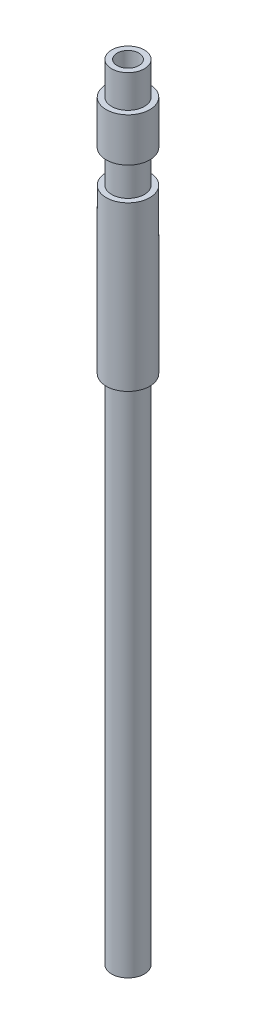
ISO-10303-21;
HEADER;
FILE_DESCRIPTION(('STEP AP214'),'2;1');
FILE_NAME('part.step','',(''),(''),'','','');
FILE_SCHEMA(('AUTOMOTIVE_DESIGN { 1 0 10303 214 1 1 1 1 }'));
ENDSEC;
DATA;
#1=APPLICATION_CONTEXT('core data for automotive mechanical design processes');
#2=APPLICATION_PROTOCOL_DEFINITION('international standard','automotive_design',2000,#1);
#3=PRODUCT_CONTEXT('',#1,'mechanical');
#4=PRODUCT('Part','Part','',(#3));
#5=PRODUCT_RELATED_PRODUCT_CATEGORY('part','',(#4));
#6=PRODUCT_DEFINITION_FORMATION('','',#4);
#7=PRODUCT_DEFINITION_CONTEXT('part definition',#1,'design');
#8=PRODUCT_DEFINITION('design','',#6,#7);
#9=PRODUCT_DEFINITION_SHAPE('','',#8);
#10=(LENGTH_UNIT() NAMED_UNIT(*) SI_UNIT(.MILLI.,.METRE.));
#11=(NAMED_UNIT(*) PLANE_ANGLE_UNIT() SI_UNIT($,.RADIAN.));
#12=(NAMED_UNIT(*) SI_UNIT($,.STERADIAN.) SOLID_ANGLE_UNIT());
#13=UNCERTAINTY_MEASURE_WITH_UNIT(LENGTH_MEASURE(1.E-05),#10,'distance_accuracy_value','');
#14=(GEOMETRIC_REPRESENTATION_CONTEXT(3) GLOBAL_UNCERTAINTY_ASSIGNED_CONTEXT((#13)) GLOBAL_UNIT_ASSIGNED_CONTEXT((#10,
#11,#12)) REPRESENTATION_CONTEXT('',''));
#15=CARTESIAN_POINT('',(0.,0.,0.));
#16=DIRECTION('',(0.,0.,1.));
#17=DIRECTION('',(1.,0.,0.));
#18=AXIS2_PLACEMENT_3D('',#15,#16,#17);
#19=CARTESIAN_POINT('',(0.,0.,0.));
#20=DIRECTION('',(0.,1.,0.));
#21=DIRECTION('',(0.,0.,1.));
#22=AXIS2_PLACEMENT_3D('',#19,#20,#21);
#23=PLANE('',#22);
#24=CARTESIAN_POINT('',(0.,0.,0.));
#25=DIRECTION('',(0.,1.,0.));
#26=DIRECTION('',(0.,0.,1.));
#27=AXIS2_PLACEMENT_3D('',#24,#25,#26);
#28=CIRCLE('',#27,1.);
#29=CARTESIAN_POINT('',(0.,0.,1.));
#30=VERTEX_POINT('',#29);
#31=EDGE_CURVE('E36',#30,#30,#28,.T.);
#32=ORIENTED_EDGE('',*,*,#31,.T.);
#33=EDGE_LOOP('',(#32));
#34=FACE_BOUND('',#33,.T.);
#35=CARTESIAN_POINT('',(0.,0.,0.));
#36=DIRECTION('',(0.,-1.,0.));
#37=DIRECTION('',(0.,0.,-1.));
#38=AXIS2_PLACEMENT_3D('',#35,#36,#37);
#39=CIRCLE('',#38,1.5);
#40=CARTESIAN_POINT('',(0.,0.,-1.5));
#41=VERTEX_POINT('',#40);
#42=EDGE_CURVE('E71',#41,#41,#39,.T.);
#43=ORIENTED_EDGE('',*,*,#42,.T.);
#44=EDGE_LOOP('',(#43));
#45=FACE_BOUND('',#44,.T.);
#46=ADVANCED_FACE('F32',(#34,#45),#23,.F.);
#47=CARTESIAN_POINT('',(0.,72.,0.));
#48=DIRECTION('',(0.,-1.,0.));
#49=DIRECTION('',(0.,0.,-1.));
#50=AXIS2_PLACEMENT_3D('',#47,#48,#49);
#51=CYLINDRICAL_SURFACE('',#50,2.);
#52=CARTESIAN_POINT('',(0.,47.,0.));
#53=DIRECTION('',(0.,-1.,0.));
#54=DIRECTION('',(0.,0.,-1.));
#55=AXIS2_PLACEMENT_3D('',#52,#53,#54);
#56=CIRCLE('',#55,1.99999999999999);
#57=CARTESIAN_POINT('',(0.,47.,-1.99999999999999));
#58=VERTEX_POINT('',#57);
#59=EDGE_CURVE('E65',#58,#58,#56,.T.);
#60=ORIENTED_EDGE('',*,*,#59,.F.);
#61=EDGE_LOOP('',(#60));
#62=FACE_BOUND('',#61,.T.);
#63=CARTESIAN_POINT('',(0.,62.,0.));
#64=DIRECTION('',(0.,1.,0.));
#65=DIRECTION('',(0.,0.,1.));
#66=AXIS2_PLACEMENT_3D('',#63,#64,#65);
#67=CIRCLE('',#66,2.);
#68=CARTESIAN_POINT('',(0.,62.,2.));
#69=VERTEX_POINT('',#68);
#70=EDGE_CURVE('E53',#69,#69,#67,.T.);
#71=ORIENTED_EDGE('',*,*,#70,.F.);
#72=EDGE_LOOP('',(#71));
#73=FACE_BOUND('',#72,.T.);
#74=ADVANCED_FACE('F34',(#62,#73),#51,.T.);
#75=CARTESIAN_POINT('',(0.,69.,0.));
#76=DIRECTION('',(0.,1.,0.));
#77=DIRECTION('',(0.,0.,1.));
#78=AXIS2_PLACEMENT_3D('',#75,#76,#77);
#79=CIRCLE('',#78,2.);
#80=CARTESIAN_POINT('',(0.,69.,2.));
#81=VERTEX_POINT('',#80);
#82=EDGE_CURVE('E43',#81,#81,#79,.T.);
#83=ORIENTED_EDGE('',*,*,#82,.F.);
#84=EDGE_LOOP('',(#83));
#85=FACE_BOUND('',#84,.T.);
#86=CARTESIAN_POINT('',(0.,65.,0.));
#87=DIRECTION('',(0.,1.,0.));
#88=DIRECTION('',(0.,0.,1.));
#89=AXIS2_PLACEMENT_3D('',#86,#87,#88);
#90=CIRCLE('',#89,2.);
#91=CARTESIAN_POINT('',(0.,65.,2.));
#92=VERTEX_POINT('',#91);
#93=EDGE_CURVE('E62',#92,#92,#90,.T.);
#94=ORIENTED_EDGE('',*,*,#93,.T.);
#95=EDGE_LOOP('',(#94));
#96=FACE_BOUND('',#95,.T.);
#97=ADVANCED_FACE('F91',(#85,#96),#51,.T.);
#98=CARTESIAN_POINT('',(0.,72.,0.));
#99=DIRECTION('',(0.,1.,0.));
#100=DIRECTION('',(0.,0.,1.));
#101=AXIS2_PLACEMENT_3D('',#98,#99,#100);
#102=PLANE('',#101);
#103=CARTESIAN_POINT('',(0.,72.,0.));
#104=DIRECTION('',(0.,1.,0.));
#105=DIRECTION('',(0.,0.,1.));
#106=AXIS2_PLACEMENT_3D('',#103,#104,#105);
#107=CIRCLE('',#106,1.);
#108=CARTESIAN_POINT('',(0.,72.,1.));
#109=VERTEX_POINT('',#108);
#110=EDGE_CURVE('E10',#109,#109,#107,.T.);
#111=ORIENTED_EDGE('',*,*,#110,.F.);
#112=EDGE_LOOP('',(#111));
#113=FACE_BOUND('',#112,.T.);
#114=CARTESIAN_POINT('',(0.,72.,0.));
#115=DIRECTION('',(0.,1.,0.));
#116=DIRECTION('',(0.,0.,1.));
#117=AXIS2_PLACEMENT_3D('',#114,#115,#116);
#118=CIRCLE('',#117,1.5);
#119=CARTESIAN_POINT('',(0.,72.,1.5));
#120=VERTEX_POINT('',#119);
#121=EDGE_CURVE('E50',#120,#120,#118,.T.);
#122=ORIENTED_EDGE('',*,*,#121,.T.);
#123=EDGE_LOOP('',(#122));
#124=FACE_BOUND('',#123,.T.);
#125=ADVANCED_FACE('F113',(#113,#124),#102,.T.);
#126=CARTESIAN_POINT('',(0.,72.,0.));
#127=DIRECTION('',(0.,-1.,0.));
#128=DIRECTION('',(0.,0.,-1.));
#129=AXIS2_PLACEMENT_3D('',#126,#127,#128);
#130=CYLINDRICAL_SURFACE('',#129,1.);
#131=ORIENTED_EDGE('',*,*,#110,.T.);
#132=EDGE_LOOP('',(#131));
#133=FACE_BOUND('',#132,.T.);
#134=ORIENTED_EDGE('',*,*,#31,.F.);
#135=EDGE_LOOP('',(#134));
#136=FACE_BOUND('',#135,.T.);
#137=ADVANCED_FACE('F118',(#133,#136),#130,.F.);
#138=CARTESIAN_POINT('',(2.,69.,0.));
#139=DIRECTION('',(0.,1.,0.));
#140=DIRECTION('',(0.,0.,1.));
#141=AXIS2_PLACEMENT_3D('',#138,#139,#140);
#142=PLANE('',#141);
#143=ORIENTED_EDGE('',*,*,#82,.T.);
#144=EDGE_LOOP('',(#143));
#145=FACE_BOUND('',#144,.T.);
#146=CARTESIAN_POINT('',(0.,69.,0.));
#147=DIRECTION('',(0.,1.,0.));
#148=DIRECTION('',(0.,0.,1.));
#149=AXIS2_PLACEMENT_3D('',#146,#147,#148);
#150=CIRCLE('',#149,1.5);
#151=CARTESIAN_POINT('',(0.,69.,1.5));
#152=VERTEX_POINT('',#151);
#153=EDGE_CURVE('E47',#152,#152,#150,.T.);
#154=ORIENTED_EDGE('',*,*,#153,.F.);
#155=EDGE_LOOP('',(#154));
#156=FACE_BOUND('',#155,.T.);
#157=ADVANCED_FACE('F129',(#145,#156),#142,.T.);
#158=CARTESIAN_POINT('',(0.,72.,0.));
#159=DIRECTION('',(0.,1.,0.));
#160=DIRECTION('',(0.,0.,1.));
#161=AXIS2_PLACEMENT_3D('',#158,#159,#160);
#162=CYLINDRICAL_SURFACE('',#161,1.5);
#163=ORIENTED_EDGE('',*,*,#153,.T.);
#164=EDGE_LOOP('',(#163));
#165=FACE_BOUND('',#164,.T.);
#166=ORIENTED_EDGE('',*,*,#121,.F.);
#167=EDGE_LOOP('',(#166));
#168=FACE_BOUND('',#167,.T.);
#169=ADVANCED_FACE('F98',(#165,#168),#162,.T.);
#170=CARTESIAN_POINT('',(2.,62.,0.));
#171=DIRECTION('',(0.,1.,0.));
#172=DIRECTION('',(0.,0.,1.));
#173=AXIS2_PLACEMENT_3D('',#170,#171,#172);
#174=PLANE('',#173);
#175=ORIENTED_EDGE('',*,*,#70,.T.);
#176=EDGE_LOOP('',(#175));
#177=FACE_BOUND('',#176,.T.);
#178=CARTESIAN_POINT('',(0.,62.,0.));
#179=DIRECTION('',(0.,1.,0.));
#180=DIRECTION('',(0.,0.,1.));
#181=AXIS2_PLACEMENT_3D('',#178,#179,#180);
#182=CIRCLE('',#181,1.5);
#183=CARTESIAN_POINT('',(0.,62.,1.5));
#184=VERTEX_POINT('',#183);
#185=EDGE_CURVE('E56',#184,#184,#182,.T.);
#186=ORIENTED_EDGE('',*,*,#185,.F.);
#187=EDGE_LOOP('',(#186));
#188=FACE_BOUND('',#187,.T.);
#189=ADVANCED_FACE('F94',(#177,#188),#174,.T.);
#190=CARTESIAN_POINT('',(0.,72.,0.));
#191=DIRECTION('',(0.,1.,0.));
#192=DIRECTION('',(0.,0.,1.));
#193=AXIS2_PLACEMENT_3D('',#190,#191,#192);
#194=CYLINDRICAL_SURFACE('',#193,1.5);
#195=ORIENTED_EDGE('',*,*,#185,.T.);
#196=EDGE_LOOP('',(#195));
#197=FACE_BOUND('',#196,.T.);
#198=CARTESIAN_POINT('',(0.,65.,0.));
#199=DIRECTION('',(0.,1.,0.));
#200=DIRECTION('',(0.,0.,1.));
#201=AXIS2_PLACEMENT_3D('',#198,#199,#200);
#202=CIRCLE('',#201,1.5);
#203=CARTESIAN_POINT('',(0.,65.,1.5));
#204=VERTEX_POINT('',#203);
#205=EDGE_CURVE('E59',#204,#204,#202,.T.);
#206=ORIENTED_EDGE('',*,*,#205,.F.);
#207=EDGE_LOOP('',(#206));
#208=FACE_BOUND('',#207,.T.);
#209=ADVANCED_FACE('F97',(#197,#208),#194,.T.);
#210=CARTESIAN_POINT('',(2.,65.,0.));
#211=DIRECTION('',(0.,-1.,0.));
#212=DIRECTION('',(0.,0.,-1.));
#213=AXIS2_PLACEMENT_3D('',#210,#211,#212);
#214=PLANE('',#213);
#215=ORIENTED_EDGE('',*,*,#205,.T.);
#216=EDGE_LOOP('',(#215));
#217=FACE_BOUND('',#216,.T.);
#218=ORIENTED_EDGE('',*,*,#93,.F.);
#219=EDGE_LOOP('',(#218));
#220=FACE_BOUND('',#219,.T.);
#221=ADVANCED_FACE('F85',(#217,#220),#214,.T.);
#222=CARTESIAN_POINT('',(1.99999999999999,47.,0.));
#223=DIRECTION('',(0.,1.,0.));
#224=DIRECTION('',(0.,0.,1.));
#225=AXIS2_PLACEMENT_3D('',#222,#223,#224);
#226=PLANE('',#225);
#227=CARTESIAN_POINT('',(0.,47.,0.));
#228=DIRECTION('',(0.,-1.,0.));
#229=DIRECTION('',(0.,0.,-1.));
#230=AXIS2_PLACEMENT_3D('',#227,#228,#229);
#231=CIRCLE('',#230,1.49999999999999);
#232=CARTESIAN_POINT('',(0.,47.,-1.49999999999999));
#233=VERTEX_POINT('',#232);
#234=EDGE_CURVE('E68',#233,#233,#231,.T.);
#235=ORIENTED_EDGE('',*,*,#234,.F.);
#236=EDGE_LOOP('',(#235));
#237=FACE_BOUND('',#236,.T.);
#238=ORIENTED_EDGE('',*,*,#59,.T.);
#239=EDGE_LOOP('',(#238));
#240=FACE_BOUND('',#239,.T.);
#241=ADVANCED_FACE('F79',(#237,#240),#226,.F.);
#242=CARTESIAN_POINT('',(0.,0.,0.));
#243=DIRECTION('',(0.,-1.,0.));
#244=DIRECTION('',(0.,0.,-1.));
#245=AXIS2_PLACEMENT_3D('',#242,#243,#244);
#246=CYLINDRICAL_SURFACE('',#245,1.5);
#247=ORIENTED_EDGE('',*,*,#42,.F.);
#248=EDGE_LOOP('',(#247));
#249=FACE_BOUND('',#248,.T.);
#250=ORIENTED_EDGE('',*,*,#234,.T.);
#251=EDGE_LOOP('',(#250));
#252=FACE_BOUND('',#251,.T.);
#253=ADVANCED_FACE('F76',(#249,#252),#246,.T.);
#254=CLOSED_SHELL('',(#46,#74,#97,#125,#137,#157,#169,#189,#209,#221,#241,#253));
#255=MANIFOLD_SOLID_BREP('B2',#254);
#256=ADVANCED_BREP_SHAPE_REPRESENTATION('',(#18,#255),#14);
#257=SHAPE_DEFINITION_REPRESENTATION(#9,#256);
ENDSEC;
END-ISO-10303-21;
